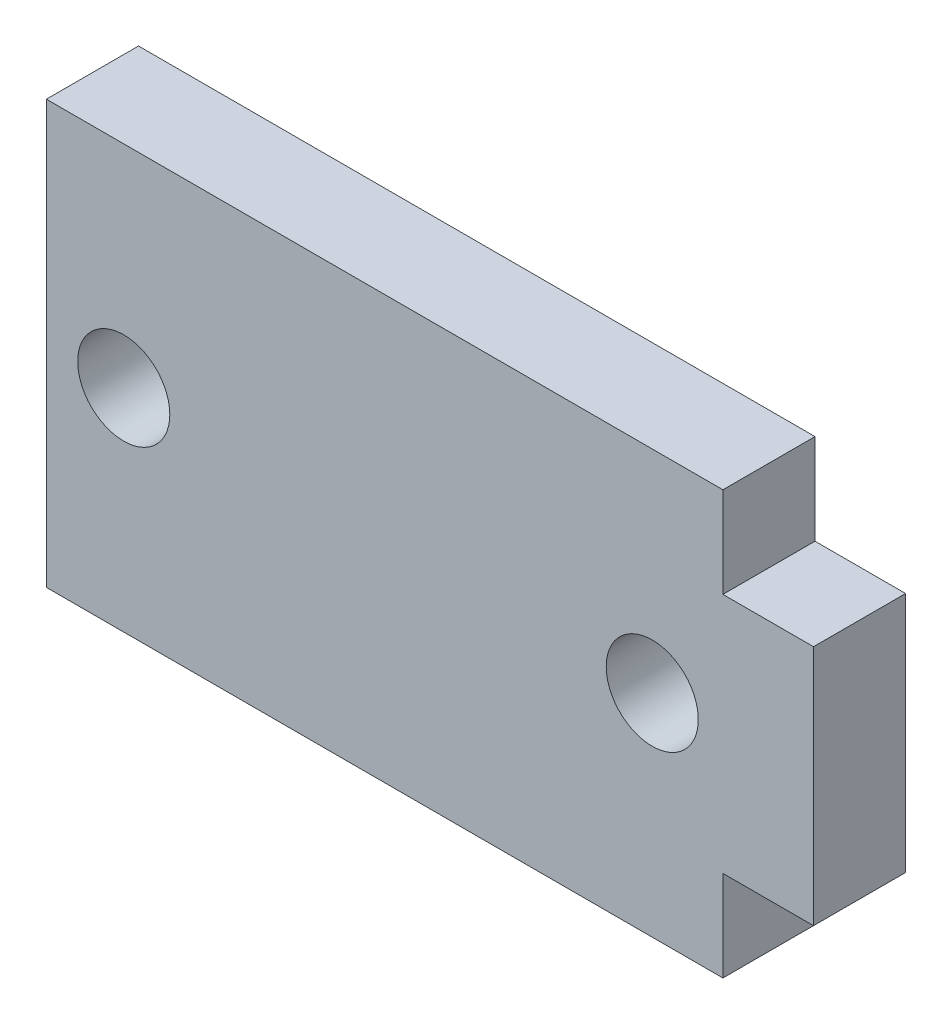
ISO-10303-21;
HEADER;
FILE_DESCRIPTION(('STEP AP214'),'2;1');
FILE_NAME('part.step','',(''),(''),'','','');
FILE_SCHEMA(('AUTOMOTIVE_DESIGN { 1 0 10303 214 1 1 1 1 }'));
ENDSEC;
DATA;
#1=APPLICATION_CONTEXT('core data for automotive mechanical design processes');
#2=APPLICATION_PROTOCOL_DEFINITION('international standard','automotive_design',2000,#1);
#3=PRODUCT_CONTEXT('',#1,'mechanical');
#4=PRODUCT('Part','Part','',(#3));
#5=PRODUCT_RELATED_PRODUCT_CATEGORY('part','',(#4));
#6=PRODUCT_DEFINITION_FORMATION('','',#4);
#7=PRODUCT_DEFINITION_CONTEXT('part definition',#1,'design');
#8=PRODUCT_DEFINITION('design','',#6,#7);
#9=PRODUCT_DEFINITION_SHAPE('','',#8);
#10=(LENGTH_UNIT() NAMED_UNIT(*) SI_UNIT(.MILLI.,.METRE.));
#11=(NAMED_UNIT(*) PLANE_ANGLE_UNIT() SI_UNIT($,.RADIAN.));
#12=(NAMED_UNIT(*) SI_UNIT($,.STERADIAN.) SOLID_ANGLE_UNIT());
#13=UNCERTAINTY_MEASURE_WITH_UNIT(LENGTH_MEASURE(1.E-05),#10,'distance_accuracy_value','');
#14=(GEOMETRIC_REPRESENTATION_CONTEXT(3) GLOBAL_UNCERTAINTY_ASSIGNED_CONTEXT((#13)) GLOBAL_UNIT_ASSIGNED_CONTEXT((#10,
#11,#12)) REPRESENTATION_CONTEXT('',''));
#15=CARTESIAN_POINT('',(0.,0.,0.));
#16=DIRECTION('',(0.,0.,1.));
#17=DIRECTION('',(1.,0.,0.));
#18=AXIS2_PLACEMENT_3D('',#15,#16,#17);
#19=CARTESIAN_POINT('',(0.,0.,3.05));
#20=DIRECTION('',(0.,0.,1.));
#21=DIRECTION('',(1.,0.,0.));
#22=AXIS2_PLACEMENT_3D('',#19,#20,#21);
#23=PLANE('',#22);
#24=CARTESIAN_POINT('',(-8.63856231307038,13.0000000000001,3.05));
#25=DIRECTION('',(0.,0.,1.));
#26=DIRECTION('',(1.,0.,0.));
#27=AXIS2_PLACEMENT_3D('',#24,#25,#26);
#28=CIRCLE('',#27,1.525);
#29=CARTESIAN_POINT('',(-7.11356231307038,13.0000000000001,3.05));
#30=VERTEX_POINT('',#29);
#31=EDGE_CURVE('E150',#30,#30,#28,.T.);
#32=ORIENTED_EDGE('',*,*,#31,.F.);
#33=EDGE_LOOP('',(#32));
#34=FACE_BOUND('',#33,.T.);
#35=DIRECTION('',(0.,-1.,0.));
#36=VECTOR('',#35,1.);
#37=CARTESIAN_POINT('',(-11.2,20.0000000000001,3.05));
#38=LINE('',#37,#36);
#39=CARTESIAN_POINT('',(-11.2,20.0000000000001,3.05));
#40=VERTEX_POINT('',#39);
#41=CARTESIAN_POINT('',(-11.2,6.00000000000012,3.05));
#42=VERTEX_POINT('',#41);
#43=EDGE_CURVE('E161',#40,#42,#38,.T.);
#44=ORIENTED_EDGE('',*,*,#43,.T.);
#45=DIRECTION('',(1.,0.,0.));
#46=VECTOR('',#45,1.);
#47=CARTESIAN_POINT('',(-11.2,6.00000000000012,3.05));
#48=LINE('',#47,#46);
#49=CARTESIAN_POINT('',(11.2,6.00000000000012,3.05));
#50=VERTEX_POINT('',#49);
#51=EDGE_CURVE('E109',#42,#50,#48,.T.);
#52=ORIENTED_EDGE('',*,*,#51,.T.);
#53=DIRECTION('',(0.,1.,0.));
#54=VECTOR('',#53,1.);
#55=CARTESIAN_POINT('',(11.2,9.,3.05));
#56=LINE('',#55,#54);
#57=CARTESIAN_POINT('',(11.2,9.,3.05));
#58=VERTEX_POINT('',#57);
#59=EDGE_CURVE('E176',#50,#58,#56,.T.);
#60=ORIENTED_EDGE('',*,*,#59,.T.);
#61=DIRECTION('',(1.,0.,0.));
#62=VECTOR('',#61,1.);
#63=CARTESIAN_POINT('',(11.2,9.,3.05));
#64=LINE('',#63,#62);
#65=CARTESIAN_POINT('',(14.2,9.,3.05));
#66=VERTEX_POINT('',#65);
#67=EDGE_CURVE('E189',#58,#66,#64,.T.);
#68=ORIENTED_EDGE('',*,*,#67,.T.);
#69=DIRECTION('',(0.,1.,0.));
#70=VECTOR('',#69,1.);
#71=CARTESIAN_POINT('',(14.2,9.,3.05));
#72=LINE('',#71,#70);
#73=CARTESIAN_POINT('',(14.2,17.,3.05));
#74=VERTEX_POINT('',#73);
#75=EDGE_CURVE('E128',#66,#74,#72,.T.);
#76=ORIENTED_EDGE('',*,*,#75,.T.);
#77=DIRECTION('',(-1.,0.,0.));
#78=VECTOR('',#77,1.);
#79=CARTESIAN_POINT('',(11.2,17.,3.05));
#80=LINE('',#79,#78);
#81=CARTESIAN_POINT('',(11.2,17.,3.05));
#82=VERTEX_POINT('',#81);
#83=EDGE_CURVE('E122',#74,#82,#80,.T.);
#84=ORIENTED_EDGE('',*,*,#83,.T.);
#85=DIRECTION('',(0.,1.,0.));
#86=VECTOR('',#85,1.);
#87=CARTESIAN_POINT('',(11.2,20.0000000000001,3.05));
#88=LINE('',#87,#86);
#89=CARTESIAN_POINT('',(11.2,20.0000000000001,3.05));
#90=VERTEX_POINT('',#89);
#91=EDGE_CURVE('E126',#82,#90,#88,.T.);
#92=ORIENTED_EDGE('',*,*,#91,.T.);
#93=DIRECTION('',(-1.,0.,0.));
#94=VECTOR('',#93,1.);
#95=CARTESIAN_POINT('',(-11.2,20.0000000000001,3.05));
#96=LINE('',#95,#94);
#97=EDGE_CURVE('E66',#90,#40,#96,.T.);
#98=ORIENTED_EDGE('',*,*,#97,.T.);
#99=EDGE_LOOP('',(#44,#52,#60,#68,#76,#84,#92,#98));
#100=FACE_BOUND('',#99,.T.);
#101=CARTESIAN_POINT('',(8.86143768692962,13.,3.05));
#102=DIRECTION('',(0.,0.,1.));
#103=DIRECTION('',(-1.,0.,0.));
#104=AXIS2_PLACEMENT_3D('',#101,#102,#103);
#105=CIRCLE('',#104,1.525);
#106=CARTESIAN_POINT('',(7.33643768692962,13.,3.05));
#107=VERTEX_POINT('',#106);
#108=EDGE_CURVE('E198',#107,#107,#105,.T.);
#109=ORIENTED_EDGE('',*,*,#108,.F.);
#110=EDGE_LOOP('',(#109));
#111=FACE_BOUND('',#110,.T.);
#112=ADVANCED_FACE('F49',(#34,#100,#111),#23,.T.);
#113=CARTESIAN_POINT('',(0.,0.,0.));
#114=DIRECTION('',(0.,0.,1.));
#115=DIRECTION('',(1.,0.,0.));
#116=AXIS2_PLACEMENT_3D('',#113,#114,#115);
#117=PLANE('',#116);
#118=DIRECTION('',(0.,-1.,0.));
#119=VECTOR('',#118,1.);
#120=CARTESIAN_POINT('',(-11.2,20.0000000000001,0.));
#121=LINE('',#120,#119);
#122=CARTESIAN_POINT('',(-11.2,20.0000000000001,0.));
#123=VERTEX_POINT('',#122);
#124=CARTESIAN_POINT('',(-11.2,6.00000000000012,0.));
#125=VERTEX_POINT('',#124);
#126=EDGE_CURVE('E146',#123,#125,#121,.T.);
#127=ORIENTED_EDGE('',*,*,#126,.F.);
#128=DIRECTION('',(-1.,0.,0.));
#129=VECTOR('',#128,1.);
#130=CARTESIAN_POINT('',(-11.2,20.0000000000001,0.));
#131=LINE('',#130,#129);
#132=CARTESIAN_POINT('',(11.2,20.0000000000001,0.));
#133=VERTEX_POINT('',#132);
#134=EDGE_CURVE('E101',#133,#123,#131,.T.);
#135=ORIENTED_EDGE('',*,*,#134,.F.);
#136=DIRECTION('',(0.,1.,0.));
#137=VECTOR('',#136,1.);
#138=CARTESIAN_POINT('',(11.2,20.0000000000001,0.));
#139=LINE('',#138,#137);
#140=CARTESIAN_POINT('',(11.2,17.,0.));
#141=VERTEX_POINT('',#140);
#142=EDGE_CURVE('E95',#141,#133,#139,.T.);
#143=ORIENTED_EDGE('',*,*,#142,.F.);
#144=DIRECTION('',(-1.,0.,0.));
#145=VECTOR('',#144,1.);
#146=CARTESIAN_POINT('',(11.2,17.,0.));
#147=LINE('',#146,#145);
#148=CARTESIAN_POINT('',(14.2,17.,0.));
#149=VERTEX_POINT('',#148);
#150=EDGE_CURVE('E136',#149,#141,#147,.T.);
#151=ORIENTED_EDGE('',*,*,#150,.F.);
#152=DIRECTION('',(0.,1.,0.));
#153=VECTOR('',#152,1.);
#154=CARTESIAN_POINT('',(14.2,9.,0.));
#155=LINE('',#154,#153);
#156=CARTESIAN_POINT('',(14.2,9.,0.));
#157=VERTEX_POINT('',#156);
#158=EDGE_CURVE('E156',#157,#149,#155,.T.);
#159=ORIENTED_EDGE('',*,*,#158,.F.);
#160=DIRECTION('',(1.,0.,0.));
#161=VECTOR('',#160,1.);
#162=CARTESIAN_POINT('',(11.2,9.,0.));
#163=LINE('',#162,#161);
#164=CARTESIAN_POINT('',(11.2,9.,0.));
#165=VERTEX_POINT('',#164);
#166=EDGE_CURVE('E154',#165,#157,#163,.T.);
#167=ORIENTED_EDGE('',*,*,#166,.F.);
#168=DIRECTION('',(0.,1.,0.));
#169=VECTOR('',#168,1.);
#170=CARTESIAN_POINT('',(11.2,9.,0.));
#171=LINE('',#170,#169);
#172=CARTESIAN_POINT('',(11.2,6.00000000000012,0.));
#173=VERTEX_POINT('',#172);
#174=EDGE_CURVE('E152',#173,#165,#171,.T.);
#175=ORIENTED_EDGE('',*,*,#174,.F.);
#176=DIRECTION('',(1.,0.,0.));
#177=VECTOR('',#176,1.);
#178=CARTESIAN_POINT('',(-11.2,6.00000000000012,0.));
#179=LINE('',#178,#177);
#180=EDGE_CURVE('E149',#125,#173,#179,.T.);
#181=ORIENTED_EDGE('',*,*,#180,.F.);
#182=EDGE_LOOP('',(#127,#135,#143,#151,#159,#167,#175,#181));
#183=FACE_BOUND('',#182,.T.);
#184=CARTESIAN_POINT('',(-8.63856231307038,13.0000000000001,0.));
#185=DIRECTION('',(0.,0.,1.));
#186=DIRECTION('',(1.,0.,0.));
#187=AXIS2_PLACEMENT_3D('',#184,#185,#186);
#188=CIRCLE('',#187,1.525);
#189=CARTESIAN_POINT('',(-7.11356231307038,13.0000000000001,0.));
#190=VERTEX_POINT('',#189);
#191=EDGE_CURVE('E195',#190,#190,#188,.T.);
#192=ORIENTED_EDGE('',*,*,#191,.T.);
#193=EDGE_LOOP('',(#192));
#194=FACE_BOUND('',#193,.T.);
#195=CARTESIAN_POINT('',(8.86143768692962,13.,0.));
#196=DIRECTION('',(0.,0.,1.));
#197=DIRECTION('',(-1.,0.,0.));
#198=AXIS2_PLACEMENT_3D('',#195,#196,#197);
#199=CIRCLE('',#198,1.525);
#200=CARTESIAN_POINT('',(7.33643768692962,13.,0.));
#201=VERTEX_POINT('',#200);
#202=EDGE_CURVE('E201',#201,#201,#199,.T.);
#203=ORIENTED_EDGE('',*,*,#202,.T.);
#204=EDGE_LOOP('',(#203));
#205=FACE_BOUND('',#204,.T.);
#206=ADVANCED_FACE('F180',(#183,#194,#205),#117,.F.);
#207=CARTESIAN_POINT('',(-11.2,20.0000000000001,3.05));
#208=DIRECTION('',(1.,0.,0.));
#209=DIRECTION('',(0.,0.,-1.));
#210=AXIS2_PLACEMENT_3D('',#207,#208,#209);
#211=PLANE('',#210);
#212=ORIENTED_EDGE('',*,*,#126,.T.);
#213=DIRECTION('',(0.,0.,-1.));
#214=VECTOR('',#213,1.);
#215=CARTESIAN_POINT('',(-11.2,6.00000000000012,3.05));
#216=LINE('',#215,#214);
#217=EDGE_CURVE('E13',#42,#125,#216,.T.);
#218=ORIENTED_EDGE('',*,*,#217,.F.);
#219=ORIENTED_EDGE('',*,*,#43,.F.);
#220=DIRECTION('',(0.,0.,-1.));
#221=VECTOR('',#220,1.);
#222=CARTESIAN_POINT('',(-11.2,20.0000000000001,3.05));
#223=LINE('',#222,#221);
#224=EDGE_CURVE('E142',#40,#123,#223,.T.);
#225=ORIENTED_EDGE('',*,*,#224,.T.);
#226=EDGE_LOOP('',(#212,#218,#219,#225));
#227=FACE_BOUND('',#226,.T.);
#228=ADVANCED_FACE('F51',(#227),#211,.F.);
#229=CARTESIAN_POINT('',(-11.2,6.00000000000012,3.05));
#230=DIRECTION('',(0.,1.,0.));
#231=DIRECTION('',(0.,0.,1.));
#232=AXIS2_PLACEMENT_3D('',#229,#230,#231);
#233=PLANE('',#232);
#234=ORIENTED_EDGE('',*,*,#180,.T.);
#235=DIRECTION('',(0.,0.,-1.));
#236=VECTOR('',#235,1.);
#237=CARTESIAN_POINT('',(11.2,6.00000000000012,3.05));
#238=LINE('',#237,#236);
#239=EDGE_CURVE('E58',#50,#173,#238,.T.);
#240=ORIENTED_EDGE('',*,*,#239,.F.);
#241=ORIENTED_EDGE('',*,*,#51,.F.);
#242=ORIENTED_EDGE('',*,*,#217,.T.);
#243=EDGE_LOOP('',(#234,#240,#241,#242));
#244=FACE_BOUND('',#243,.T.);
#245=ADVANCED_FACE('F233',(#244),#233,.F.);
#246=CARTESIAN_POINT('',(11.2,9.,3.05));
#247=DIRECTION('',(-1.,0.,0.));
#248=DIRECTION('',(0.,-1.,0.));
#249=AXIS2_PLACEMENT_3D('',#246,#247,#248);
#250=PLANE('',#249);
#251=ORIENTED_EDGE('',*,*,#174,.T.);
#252=DIRECTION('',(0.,0.,-1.));
#253=VECTOR('',#252,1.);
#254=CARTESIAN_POINT('',(11.2,9.,3.05));
#255=LINE('',#254,#253);
#256=EDGE_CURVE('E168',#58,#165,#255,.T.);
#257=ORIENTED_EDGE('',*,*,#256,.F.);
#258=ORIENTED_EDGE('',*,*,#59,.F.);
#259=ORIENTED_EDGE('',*,*,#239,.T.);
#260=EDGE_LOOP('',(#251,#257,#258,#259));
#261=FACE_BOUND('',#260,.T.);
#262=ADVANCED_FACE('F174',(#261),#250,.F.);
#263=CARTESIAN_POINT('',(11.2,9.,3.05));
#264=DIRECTION('',(0.,1.,0.));
#265=DIRECTION('',(-1.,0.,0.));
#266=AXIS2_PLACEMENT_3D('',#263,#264,#265);
#267=PLANE('',#266);
#268=ORIENTED_EDGE('',*,*,#166,.T.);
#269=DIRECTION('',(0.,0.,-1.));
#270=VECTOR('',#269,1.);
#271=CARTESIAN_POINT('',(14.2,9.,3.05));
#272=LINE('',#271,#270);
#273=EDGE_CURVE('E165',#66,#157,#272,.T.);
#274=ORIENTED_EDGE('',*,*,#273,.F.);
#275=ORIENTED_EDGE('',*,*,#67,.F.);
#276=ORIENTED_EDGE('',*,*,#256,.T.);
#277=EDGE_LOOP('',(#268,#274,#275,#276));
#278=FACE_BOUND('',#277,.T.);
#279=ADVANCED_FACE('F185',(#278),#267,.F.);
#280=CARTESIAN_POINT('',(14.2,9.,3.05));
#281=DIRECTION('',(-1.,0.,0.));
#282=DIRECTION('',(0.,0.,1.));
#283=AXIS2_PLACEMENT_3D('',#280,#281,#282);
#284=PLANE('',#283);
#285=ORIENTED_EDGE('',*,*,#158,.T.);
#286=DIRECTION('',(0.,0.,-1.));
#287=VECTOR('',#286,1.);
#288=CARTESIAN_POINT('',(14.2,17.,3.05));
#289=LINE('',#288,#287);
#290=EDGE_CURVE('E137',#74,#149,#289,.T.);
#291=ORIENTED_EDGE('',*,*,#290,.F.);
#292=ORIENTED_EDGE('',*,*,#75,.F.);
#293=ORIENTED_EDGE('',*,*,#273,.T.);
#294=EDGE_LOOP('',(#285,#291,#292,#293));
#295=FACE_BOUND('',#294,.T.);
#296=ADVANCED_FACE('F188',(#295),#284,.F.);
#297=CARTESIAN_POINT('',(11.2,17.,3.05));
#298=DIRECTION('',(0.,-1.,0.));
#299=DIRECTION('',(1.,0.,0.));
#300=AXIS2_PLACEMENT_3D('',#297,#298,#299);
#301=PLANE('',#300);
#302=ORIENTED_EDGE('',*,*,#150,.T.);
#303=DIRECTION('',(0.,0.,-1.));
#304=VECTOR('',#303,1.);
#305=CARTESIAN_POINT('',(11.2,17.,3.05));
#306=LINE('',#305,#304);
#307=EDGE_CURVE('E133',#82,#141,#306,.T.);
#308=ORIENTED_EDGE('',*,*,#307,.F.);
#309=ORIENTED_EDGE('',*,*,#83,.F.);
#310=ORIENTED_EDGE('',*,*,#290,.T.);
#311=EDGE_LOOP('',(#302,#308,#309,#310));
#312=FACE_BOUND('',#311,.T.);
#313=ADVANCED_FACE('F134',(#312),#301,.F.);
#314=CARTESIAN_POINT('',(11.2,20.0000000000001,3.05));
#315=DIRECTION('',(-1.,0.,0.));
#316=DIRECTION('',(0.,-1.,0.));
#317=AXIS2_PLACEMENT_3D('',#314,#315,#316);
#318=PLANE('',#317);
#319=ORIENTED_EDGE('',*,*,#142,.T.);
#320=DIRECTION('',(0.,0.,-1.));
#321=VECTOR('',#320,1.);
#322=CARTESIAN_POINT('',(11.2,20.0000000000001,3.05));
#323=LINE('',#322,#321);
#324=EDGE_CURVE('E138',#90,#133,#323,.T.);
#325=ORIENTED_EDGE('',*,*,#324,.F.);
#326=ORIENTED_EDGE('',*,*,#91,.F.);
#327=ORIENTED_EDGE('',*,*,#307,.T.);
#328=EDGE_LOOP('',(#319,#325,#326,#327));
#329=FACE_BOUND('',#328,.T.);
#330=ADVANCED_FACE('F140',(#329),#318,.F.);
#331=CARTESIAN_POINT('',(-11.2,20.0000000000001,3.05));
#332=DIRECTION('',(0.,-1.,0.));
#333=DIRECTION('',(0.,0.,-1.));
#334=AXIS2_PLACEMENT_3D('',#331,#332,#333);
#335=PLANE('',#334);
#336=ORIENTED_EDGE('',*,*,#134,.T.);
#337=ORIENTED_EDGE('',*,*,#224,.F.);
#338=ORIENTED_EDGE('',*,*,#97,.F.);
#339=ORIENTED_EDGE('',*,*,#324,.T.);
#340=EDGE_LOOP('',(#336,#337,#338,#339));
#341=FACE_BOUND('',#340,.T.);
#342=ADVANCED_FACE('F221',(#341),#335,.F.);
#343=CARTESIAN_POINT('',(-8.63856231307038,13.0000000000001,3.05));
#344=DIRECTION('',(0.,0.,-1.));
#345=DIRECTION('',(-1.,0.,0.));
#346=AXIS2_PLACEMENT_3D('',#343,#344,#345);
#347=CYLINDRICAL_SURFACE('',#346,1.525);
#348=ORIENTED_EDGE('',*,*,#31,.T.);
#349=EDGE_LOOP('',(#348));
#350=FACE_BOUND('',#349,.T.);
#351=ORIENTED_EDGE('',*,*,#191,.F.);
#352=EDGE_LOOP('',(#351));
#353=FACE_BOUND('',#352,.T.);
#354=ADVANCED_FACE('F218',(#350,#353),#347,.F.);
#355=CARTESIAN_POINT('',(8.86143768692962,13.,3.05));
#356=DIRECTION('',(0.,0.,-1.));
#357=DIRECTION('',(-1.,0.,0.));
#358=AXIS2_PLACEMENT_3D('',#355,#356,#357);
#359=CYLINDRICAL_SURFACE('',#358,1.525);
#360=ORIENTED_EDGE('',*,*,#108,.T.);
#361=EDGE_LOOP('',(#360));
#362=FACE_BOUND('',#361,.T.);
#363=ORIENTED_EDGE('',*,*,#202,.F.);
#364=EDGE_LOOP('',(#363));
#365=FACE_BOUND('',#364,.T.);
#366=ADVANCED_FACE('F207',(#362,#365),#359,.F.);
#367=CLOSED_SHELL('',(#112,#206,#228,#245,#262,#279,#296,#313,#330,#342,#354,#366));
#368=MANIFOLD_SOLID_BREP('B2',#367);
#369=ADVANCED_BREP_SHAPE_REPRESENTATION('',(#18,#368),#14);
#370=SHAPE_DEFINITION_REPRESENTATION(#9,#369);
ENDSEC;
END-ISO-10303-21;
